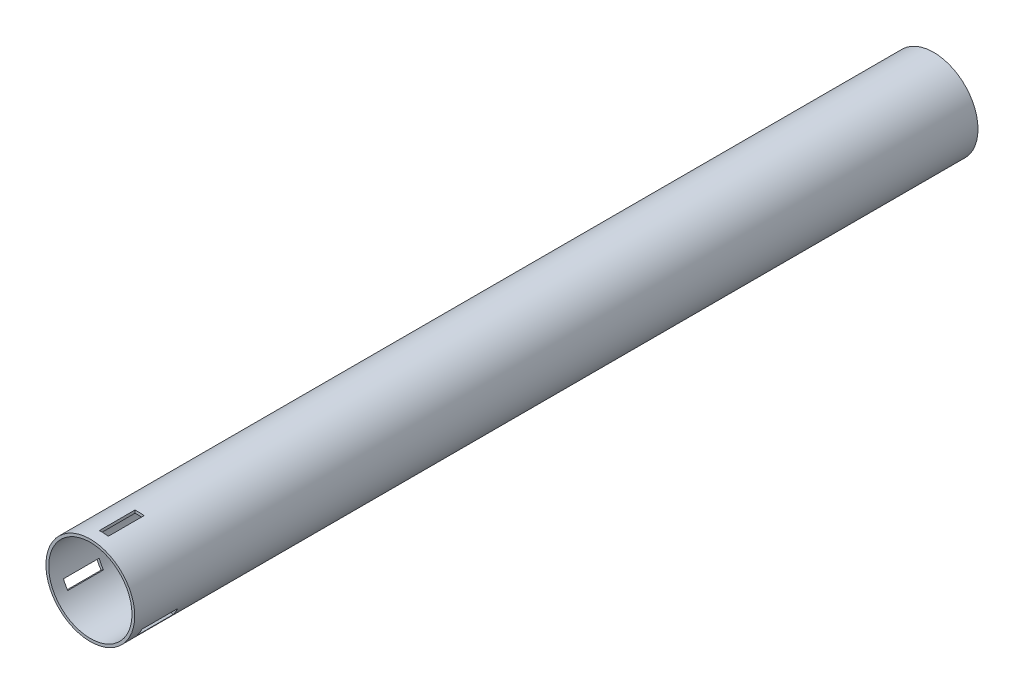
ISO-10303-21;
HEADER;
FILE_DESCRIPTION(('STEP AP214'),'2;1');
FILE_NAME('part.step','',(''),(''),'','','');
FILE_SCHEMA(('AUTOMOTIVE_DESIGN { 1 0 10303 214 1 1 1 1 }'));
ENDSEC;
DATA;
#1=APPLICATION_CONTEXT('core data for automotive mechanical design processes');
#2=APPLICATION_PROTOCOL_DEFINITION('international standard','automotive_design',2000,#1);
#3=PRODUCT_CONTEXT('',#1,'mechanical');
#4=PRODUCT('Part','Part','',(#3));
#5=PRODUCT_RELATED_PRODUCT_CATEGORY('part','',(#4));
#6=PRODUCT_DEFINITION_FORMATION('','',#4);
#7=PRODUCT_DEFINITION_CONTEXT('part definition',#1,'design');
#8=PRODUCT_DEFINITION('design','',#6,#7);
#9=PRODUCT_DEFINITION_SHAPE('','',#8);
#10=(LENGTH_UNIT() NAMED_UNIT(*) SI_UNIT(.MILLI.,.METRE.));
#11=(NAMED_UNIT(*) PLANE_ANGLE_UNIT() SI_UNIT($,.RADIAN.));
#12=(NAMED_UNIT(*) SI_UNIT($,.STERADIAN.) SOLID_ANGLE_UNIT());
#13=UNCERTAINTY_MEASURE_WITH_UNIT(LENGTH_MEASURE(1.E-05),#10,'distance_accuracy_value','');
#14=(GEOMETRIC_REPRESENTATION_CONTEXT(3) GLOBAL_UNCERTAINTY_ASSIGNED_CONTEXT((#13)) GLOBAL_UNIT_ASSIGNED_CONTEXT((#10,
#11,#12)) REPRESENTATION_CONTEXT('',''));
#15=CARTESIAN_POINT('',(0.,0.,0.));
#16=DIRECTION('',(0.,0.,1.));
#17=DIRECTION('',(1.,0.,0.));
#18=AXIS2_PLACEMENT_3D('',#15,#16,#17);
#19=CARTESIAN_POINT('',(0.,0.,450.));
#20=DIRECTION('',(0.,0.,1.));
#21=DIRECTION('',(1.,0.,0.));
#22=AXIS2_PLACEMENT_3D('',#19,#20,#21);
#23=PLANE('',#22);
#24=CARTESIAN_POINT('',(0.,0.,450.));
#25=DIRECTION('',(0.,0.,1.));
#26=DIRECTION('',(1.,0.,0.));
#27=AXIS2_PLACEMENT_3D('',#24,#25,#26);
#28=CIRCLE('',#27,23.6982);
#29=CARTESIAN_POINT('',(23.6982,0.,450.));
#30=VERTEX_POINT('',#29);
#31=EDGE_CURVE('E11',#30,#30,#28,.T.);
#32=ORIENTED_EDGE('',*,*,#31,.T.);
#33=EDGE_LOOP('',(#32));
#34=FACE_BOUND('',#33,.T.);
#35=CARTESIAN_POINT('',(0.,0.,450.));
#36=DIRECTION('',(0.,0.,1.));
#37=DIRECTION('',(1.,0.,0.));
#38=AXIS2_PLACEMENT_3D('',#35,#36,#37);
#39=CIRCLE('',#38,22.225);
#40=CARTESIAN_POINT('',(22.225,0.,450.));
#41=VERTEX_POINT('',#40);
#42=EDGE_CURVE('E225',#41,#41,#39,.T.);
#43=ORIENTED_EDGE('',*,*,#42,.F.);
#44=EDGE_LOOP('',(#43));
#45=FACE_BOUND('',#44,.T.);
#46=ADVANCED_FACE('F33',(#34,#45),#23,.T.);
#47=CARTESIAN_POINT('',(0.,0.,0.));
#48=DIRECTION('',(0.,0.,1.));
#49=DIRECTION('',(1.,0.,0.));
#50=AXIS2_PLACEMENT_3D('',#47,#48,#49);
#51=PLANE('',#50);
#52=CARTESIAN_POINT('',(0.,0.,0.));
#53=DIRECTION('',(0.,0.,1.));
#54=DIRECTION('',(1.,0.,0.));
#55=AXIS2_PLACEMENT_3D('',#52,#53,#54);
#56=CIRCLE('',#55,23.6982);
#57=CARTESIAN_POINT('',(23.6982,0.,0.));
#58=VERTEX_POINT('',#57);
#59=EDGE_CURVE('E37',#58,#58,#56,.T.);
#60=ORIENTED_EDGE('',*,*,#59,.F.);
#61=EDGE_LOOP('',(#60));
#62=FACE_BOUND('',#61,.T.);
#63=CARTESIAN_POINT('',(0.,0.,0.));
#64=DIRECTION('',(0.,0.,1.));
#65=DIRECTION('',(1.,0.,0.));
#66=AXIS2_PLACEMENT_3D('',#63,#64,#65);
#67=CIRCLE('',#66,22.225);
#68=CARTESIAN_POINT('',(22.225,0.,0.));
#69=VERTEX_POINT('',#68);
#70=EDGE_CURVE('E224',#69,#69,#67,.T.);
#71=ORIENTED_EDGE('',*,*,#70,.T.);
#72=EDGE_LOOP('',(#71));
#73=FACE_BOUND('',#72,.T.);
#74=ADVANCED_FACE('F231',(#62,#73),#51,.F.);
#75=CARTESIAN_POINT('',(0.,0.,450.));
#76=DIRECTION('',(0.,0.,-1.));
#77=DIRECTION('',(-1.,0.,0.));
#78=AXIS2_PLACEMENT_3D('',#75,#76,#77);
#79=CYLINDRICAL_SURFACE('',#78,23.6982);
#80=CARTESIAN_POINT('',(0.,0.,424.6));
#81=DIRECTION('',(0.,0.,-1.));
#82=DIRECTION('',(-1.,0.,0.));
#83=AXIS2_PLACEMENT_3D('',#80,#81,#82);
#84=CIRCLE('',#83,23.6982);
#85=CARTESIAN_POINT('',(18.6925778750122,-14.5668189947773,424.6));
#86=VERTEX_POINT('',#85);
#87=CARTESIAN_POINT('',(21.2708932392925,-10.447668832932,424.6));
#88=VERTEX_POINT('',#87);
#89=EDGE_CURVE('E138',#86,#88,#84,.F.);
#90=ORIENTED_EDGE('',*,*,#89,.F.);
#91=DIRECTION('',(0.,0.,-1.));
#92=VECTOR('',#91,1.);
#93=CARTESIAN_POINT('',(18.6925778750122,-14.5668189947773,450.));
#94=LINE('',#93,#92);
#95=CARTESIAN_POINT('',(18.6925778750122,-14.5668189947773,443.65));
#96=VERTEX_POINT('',#95);
#97=EDGE_CURVE('E159',#96,#86,#94,.T.);
#98=ORIENTED_EDGE('',*,*,#97,.F.);
#99=CARTESIAN_POINT('',(0.,0.,443.65));
#100=DIRECTION('',(0.,0.,1.));
#101=DIRECTION('',(1.,0.,0.));
#102=AXIS2_PLACEMENT_3D('',#99,#100,#101);
#103=CIRCLE('',#102,23.6982);
#104=CARTESIAN_POINT('',(21.2708932392925,-10.447668832932,443.65));
#105=VERTEX_POINT('',#104);
#106=EDGE_CURVE('E151',#105,#96,#103,.F.);
#107=ORIENTED_EDGE('',*,*,#106,.F.);
#108=DIRECTION('',(0.,0.,-1.));
#109=VECTOR('',#108,1.);
#110=CARTESIAN_POINT('',(21.2708932392925,-10.447668832932,450.));
#111=LINE('',#110,#109);
#112=EDGE_CURVE('E48',#88,#105,#111,.F.);
#113=ORIENTED_EDGE('',*,*,#112,.F.);
#114=EDGE_LOOP('',(#90,#98,#107,#113));
#115=FACE_BOUND('',#114,.T.);
#116=CARTESIAN_POINT('',(0.,0.,424.6));
#117=DIRECTION('',(0.,0.,-1.));
#118=DIRECTION('',(-1.,0.,0.));
#119=AXIS2_PLACEMENT_3D('',#116,#117,#118);
#120=CIRCLE('',#119,23.6982);
#121=CARTESIAN_POINT('',(-21.961524239313,-8.90483780459073,424.6));
#122=VERTEX_POINT('',#121);
#123=CARTESIAN_POINT('',(-19.6833932392924,-13.1972994899479,424.6));
#124=VERTEX_POINT('',#123);
#125=EDGE_CURVE('E171',#122,#124,#120,.F.);
#126=ORIENTED_EDGE('',*,*,#125,.F.);
#127=DIRECTION('',(0.,0.,-1.));
#128=VECTOR('',#127,1.);
#129=CARTESIAN_POINT('',(-21.961524239313,-8.90483780459073,450.));
#130=LINE('',#129,#128);
#131=CARTESIAN_POINT('',(-21.961524239313,-8.90483780459074,443.65));
#132=VERTEX_POINT('',#131);
#133=EDGE_CURVE('E189',#132,#122,#130,.T.);
#134=ORIENTED_EDGE('',*,*,#133,.F.);
#135=CARTESIAN_POINT('',(0.,0.,443.65));
#136=DIRECTION('',(0.,0.,1.));
#137=DIRECTION('',(1.,0.,0.));
#138=AXIS2_PLACEMENT_3D('',#135,#136,#137);
#139=CIRCLE('',#138,23.6982);
#140=CARTESIAN_POINT('',(-19.6833932392924,-13.1972994899479,443.65));
#141=VERTEX_POINT('',#140);
#142=EDGE_CURVE('E175',#141,#132,#139,.F.);
#143=ORIENTED_EDGE('',*,*,#142,.F.);
#144=DIRECTION('',(0.,0.,-1.));
#145=VECTOR('',#144,1.);
#146=CARTESIAN_POINT('',(-19.6833932392924,-13.1972994899479,450.));
#147=LINE('',#146,#145);
#148=EDGE_CURVE('E56',#124,#141,#147,.F.);
#149=ORIENTED_EDGE('',*,*,#148,.F.);
#150=EDGE_LOOP('',(#126,#134,#143,#149));
#151=FACE_BOUND('',#150,.T.);
#152=CARTESIAN_POINT('',(0.,0.,424.6));
#153=DIRECTION('',(0.,0.,-1.));
#154=DIRECTION('',(-1.,0.,0.));
#155=AXIS2_PLACEMENT_3D('',#152,#153,#154);
#156=CIRCLE('',#155,23.6982);
#157=CARTESIAN_POINT('',(3.26894636430097,23.4716567993681,424.6));
#158=VERTEX_POINT('',#157);
#159=CARTESIAN_POINT('',(-1.5875,23.64496832288,424.6));
#160=VERTEX_POINT('',#159);
#161=EDGE_CURVE('E201',#158,#160,#156,.F.);
#162=ORIENTED_EDGE('',*,*,#161,.F.);
#163=DIRECTION('',(0.,0.,-1.));
#164=VECTOR('',#163,1.);
#165=CARTESIAN_POINT('',(3.26894636430097,23.4716567993681,450.));
#166=LINE('',#165,#164);
#167=CARTESIAN_POINT('',(3.26894636430097,23.4716567993681,443.65));
#168=VERTEX_POINT('',#167);
#169=EDGE_CURVE('E221',#168,#158,#166,.T.);
#170=ORIENTED_EDGE('',*,*,#169,.F.);
#171=CARTESIAN_POINT('',(0.,0.,443.65));
#172=DIRECTION('',(0.,0.,1.));
#173=DIRECTION('',(1.,0.,0.));
#174=AXIS2_PLACEMENT_3D('',#171,#172,#173);
#175=CIRCLE('',#174,23.6982);
#176=CARTESIAN_POINT('',(-1.5875,23.64496832288,443.65));
#177=VERTEX_POINT('',#176);
#178=EDGE_CURVE('E205',#177,#168,#175,.F.);
#179=ORIENTED_EDGE('',*,*,#178,.F.);
#180=DIRECTION('',(0.,0.,-1.));
#181=VECTOR('',#180,1.);
#182=CARTESIAN_POINT('',(-1.5875,23.64496832288,450.));
#183=LINE('',#182,#181);
#184=EDGE_CURVE('E203',#160,#177,#183,.F.);
#185=ORIENTED_EDGE('',*,*,#184,.F.);
#186=EDGE_LOOP('',(#162,#170,#179,#185));
#187=FACE_BOUND('',#186,.T.);
#188=ORIENTED_EDGE('',*,*,#31,.F.);
#189=EDGE_LOOP('',(#188));
#190=FACE_BOUND('',#189,.T.);
#191=ORIENTED_EDGE('',*,*,#59,.T.);
#192=EDGE_LOOP('',(#191));
#193=FACE_BOUND('',#192,.T.);
#194=ADVANCED_FACE('F35',(#115,#151,#187,#190,#193),#79,.T.);
#195=CARTESIAN_POINT('',(0.,0.,450.));
#196=DIRECTION('',(0.,0.,-1.));
#197=DIRECTION('',(-1.,0.,0.));
#198=AXIS2_PLACEMENT_3D('',#195,#196,#197);
#199=CYLINDRICAL_SURFACE('',#198,22.225);
#200=DIRECTION('',(0.,0.,-1.));
#201=VECTOR('',#200,1.);
#202=CARTESIAN_POINT('',(17.403606053962,-13.8226307669162,450.));
#203=LINE('',#202,#201);
#204=CARTESIAN_POINT('',(17.403606053962,-13.8226307669162,443.65));
#205=VERTEX_POINT('',#204);
#206=CARTESIAN_POINT('',(17.403606053962,-13.8226307669162,424.6));
#207=VERTEX_POINT('',#206);
#208=EDGE_CURVE('E145',#205,#207,#203,.T.);
#209=ORIENTED_EDGE('',*,*,#208,.T.);
#210=CARTESIAN_POINT('',(0.,0.,424.6));
#211=DIRECTION('',(0.,0.,-1.));
#212=DIRECTION('',(-1.,0.,0.));
#213=AXIS2_PLACEMENT_3D('',#210,#211,#212);
#214=CIRCLE('',#213,22.225);
#215=CARTESIAN_POINT('',(19.992001263136,-9.70930020623361,424.6));
#216=VERTEX_POINT('',#215);
#217=EDGE_CURVE('E132',#207,#216,#214,.F.);
#218=ORIENTED_EDGE('',*,*,#217,.T.);
#219=DIRECTION('',(0.,0.,-1.));
#220=VECTOR('',#219,1.);
#221=CARTESIAN_POINT('',(19.992001263136,-9.70930020623361,450.));
#222=LINE('',#221,#220);
#223=CARTESIAN_POINT('',(19.992001263136,-9.70930020623361,443.65));
#224=VERTEX_POINT('',#223);
#225=EDGE_CURVE('E122',#216,#224,#222,.F.);
#226=ORIENTED_EDGE('',*,*,#225,.T.);
#227=CARTESIAN_POINT('',(0.,0.,443.65));
#228=DIRECTION('',(0.,0.,1.));
#229=DIRECTION('',(1.,0.,0.));
#230=AXIS2_PLACEMENT_3D('',#227,#228,#229);
#231=CIRCLE('',#230,22.225);
#232=EDGE_CURVE('E131',#224,#205,#231,.F.);
#233=ORIENTED_EDGE('',*,*,#232,.T.);
#234=EDGE_LOOP('',(#209,#218,#226,#233));
#235=FACE_BOUND('',#234,.T.);
#236=DIRECTION('',(0.,0.,-1.));
#237=VECTOR('',#236,1.);
#238=CARTESIAN_POINT('',(-20.6725524182628,-8.16064957672957,450.));
#239=LINE('',#238,#237);
#240=CARTESIAN_POINT('',(-20.6725524182628,-8.16064957672956,443.65));
#241=VERTEX_POINT('',#240);
#242=CARTESIAN_POINT('',(-20.6725524182628,-8.16064957672957,424.6));
#243=VERTEX_POINT('',#242);
#244=EDGE_CURVE('E181',#241,#243,#239,.T.);
#245=ORIENTED_EDGE('',*,*,#244,.T.);
#246=CARTESIAN_POINT('',(0.,0.,424.6));
#247=DIRECTION('',(0.,0.,-1.));
#248=DIRECTION('',(-1.,0.,0.));
#249=AXIS2_PLACEMENT_3D('',#246,#247,#248);
#250=CIRCLE('',#249,22.225);
#251=CARTESIAN_POINT('',(-18.4045012631359,-12.4589308632495,424.6));
#252=VERTEX_POINT('',#251);
#253=EDGE_CURVE('E162',#243,#252,#250,.F.);
#254=ORIENTED_EDGE('',*,*,#253,.T.);
#255=DIRECTION('',(0.,0.,-1.));
#256=VECTOR('',#255,1.);
#257=CARTESIAN_POINT('',(-18.4045012631359,-12.4589308632495,450.));
#258=LINE('',#257,#256);
#259=CARTESIAN_POINT('',(-18.4045012631359,-12.4589308632495,443.65));
#260=VERTEX_POINT('',#259);
#261=EDGE_CURVE('E165',#252,#260,#258,.F.);
#262=ORIENTED_EDGE('',*,*,#261,.T.);
#263=CARTESIAN_POINT('',(0.,0.,443.65));
#264=DIRECTION('',(0.,0.,1.));
#265=DIRECTION('',(1.,0.,0.));
#266=AXIS2_PLACEMENT_3D('',#263,#264,#265);
#267=CIRCLE('',#266,22.225);
#268=EDGE_CURVE('E168',#260,#241,#267,.F.);
#269=ORIENTED_EDGE('',*,*,#268,.T.);
#270=EDGE_LOOP('',(#245,#254,#262,#269));
#271=FACE_BOUND('',#270,.T.);
#272=DIRECTION('',(0.,0.,-1.));
#273=VECTOR('',#272,1.);
#274=CARTESIAN_POINT('',(3.26894636430097,21.9832803436458,450.));
#275=LINE('',#274,#273);
#276=CARTESIAN_POINT('',(3.26894636430097,21.9832803436458,443.65));
#277=VERTEX_POINT('',#276);
#278=CARTESIAN_POINT('',(3.26894636430097,21.9832803436458,424.6));
#279=VERTEX_POINT('',#278);
#280=EDGE_CURVE('E211',#277,#279,#275,.T.);
#281=ORIENTED_EDGE('',*,*,#280,.T.);
#282=CARTESIAN_POINT('',(0.,0.,424.6));
#283=DIRECTION('',(0.,0.,-1.));
#284=DIRECTION('',(-1.,0.,0.));
#285=AXIS2_PLACEMENT_3D('',#282,#283,#284);
#286=CIRCLE('',#285,22.225);
#287=CARTESIAN_POINT('',(-1.5875,22.1682310694832,424.6));
#288=VERTEX_POINT('',#287);
#289=EDGE_CURVE('E192',#279,#288,#286,.F.);
#290=ORIENTED_EDGE('',*,*,#289,.T.);
#291=DIRECTION('',(0.,0.,-1.));
#292=VECTOR('',#291,1.);
#293=CARTESIAN_POINT('',(-1.5875,22.1682310694832,450.));
#294=LINE('',#293,#292);
#295=CARTESIAN_POINT('',(-1.5875,22.1682310694832,443.65));
#296=VERTEX_POINT('',#295);
#297=EDGE_CURVE('E195',#288,#296,#294,.F.);
#298=ORIENTED_EDGE('',*,*,#297,.T.);
#299=CARTESIAN_POINT('',(0.,0.,443.65));
#300=DIRECTION('',(0.,0.,1.));
#301=DIRECTION('',(1.,0.,0.));
#302=AXIS2_PLACEMENT_3D('',#299,#300,#301);
#303=CIRCLE('',#302,22.225);
#304=EDGE_CURVE('E198',#296,#277,#303,.F.);
#305=ORIENTED_EDGE('',*,*,#304,.T.);
#306=EDGE_LOOP('',(#281,#290,#298,#305));
#307=FACE_BOUND('',#306,.T.);
#308=ORIENTED_EDGE('',*,*,#42,.T.);
#309=EDGE_LOOP('',(#308));
#310=FACE_BOUND('',#309,.T.);
#311=ORIENTED_EDGE('',*,*,#70,.F.);
#312=EDGE_LOOP('',(#311));
#313=FACE_BOUND('',#312,.T.);
#314=ADVANCED_FACE('F142',(#235,#271,#307,#310,#313),#199,.F.);
#315=CARTESIAN_POINT('',(3.26894636430097,-23.6992,443.65));
#316=DIRECTION('',(1.,0.,0.));
#317=DIRECTION('',(0.,0.,-1.));
#318=AXIS2_PLACEMENT_3D('',#315,#316,#317);
#319=PLANE('',#318);
#320=ORIENTED_EDGE('',*,*,#169,.T.);
#321=DIRECTION('',(0.,1.,0.));
#322=VECTOR('',#321,1.);
#323=CARTESIAN_POINT('',(3.26894636430097,-23.6992,424.6));
#324=LINE('',#323,#322);
#325=EDGE_CURVE('E215',#279,#158,#324,.T.);
#326=ORIENTED_EDGE('',*,*,#325,.F.);
#327=ORIENTED_EDGE('',*,*,#280,.F.);
#328=DIRECTION('',(0.,1.,0.));
#329=VECTOR('',#328,1.);
#330=CARTESIAN_POINT('',(3.26894636430097,-23.6992,443.65));
#331=LINE('',#330,#329);
#332=EDGE_CURVE('E207',#277,#168,#331,.T.);
#333=ORIENTED_EDGE('',*,*,#332,.T.);
#334=EDGE_LOOP('',(#320,#326,#327,#333));
#335=FACE_BOUND('',#334,.T.);
#336=ADVANCED_FACE('F234',(#335),#319,.F.);
#337=CARTESIAN_POINT('',(-1.5875,-23.6992,424.6));
#338=DIRECTION('',(0.,0.,-1.));
#339=DIRECTION('',(-1.,0.,0.));
#340=AXIS2_PLACEMENT_3D('',#337,#338,#339);
#341=PLANE('',#340);
#342=ORIENTED_EDGE('',*,*,#161,.T.);
#343=DIRECTION('',(0.,1.,0.));
#344=VECTOR('',#343,1.);
#345=CARTESIAN_POINT('',(-1.5875,-23.6992,424.6));
#346=LINE('',#345,#344);
#347=EDGE_CURVE('E212',#288,#160,#346,.T.);
#348=ORIENTED_EDGE('',*,*,#347,.F.);
#349=ORIENTED_EDGE('',*,*,#289,.F.);
#350=ORIENTED_EDGE('',*,*,#325,.T.);
#351=EDGE_LOOP('',(#342,#348,#349,#350));
#352=FACE_BOUND('',#351,.T.);
#353=ADVANCED_FACE('F240',(#352),#341,.F.);
#354=CARTESIAN_POINT('',(-1.5875,-23.6992,443.65));
#355=DIRECTION('',(-1.,0.,0.));
#356=DIRECTION('',(0.,0.,1.));
#357=AXIS2_PLACEMENT_3D('',#354,#355,#356);
#358=PLANE('',#357);
#359=ORIENTED_EDGE('',*,*,#184,.T.);
#360=DIRECTION('',(0.,1.,0.));
#361=VECTOR('',#360,1.);
#362=CARTESIAN_POINT('',(-1.5875,-23.6992,443.65));
#363=LINE('',#362,#361);
#364=EDGE_CURVE('E208',#296,#177,#363,.T.);
#365=ORIENTED_EDGE('',*,*,#364,.F.);
#366=ORIENTED_EDGE('',*,*,#297,.F.);
#367=ORIENTED_EDGE('',*,*,#347,.T.);
#368=EDGE_LOOP('',(#359,#365,#366,#367));
#369=FACE_BOUND('',#368,.T.);
#370=ADVANCED_FACE('F358',(#369),#358,.F.);
#371=CARTESIAN_POINT('',(-1.5875,-23.6992,443.65));
#372=DIRECTION('',(0.,0.,1.));
#373=DIRECTION('',(1.,0.,0.));
#374=AXIS2_PLACEMENT_3D('',#371,#372,#373);
#375=PLANE('',#374);
#376=ORIENTED_EDGE('',*,*,#178,.T.);
#377=ORIENTED_EDGE('',*,*,#332,.F.);
#378=ORIENTED_EDGE('',*,*,#304,.F.);
#379=ORIENTED_EDGE('',*,*,#364,.T.);
#380=EDGE_LOOP('',(#376,#377,#378,#379));
#381=FACE_BOUND('',#380,.T.);
#382=ADVANCED_FACE('F273',(#381),#375,.F.);
#383=CARTESIAN_POINT('',(26.4019814425335,19.0178452197776,443.65));
#384=DIRECTION('',(-0.500000000000004,0.866025403784436,0.));
#385=DIRECTION('',(-0.866025403784436,-0.500000000000004,0.));
#386=AXIS2_PLACEMENT_3D('',#383,#384,#385);
#387=PLANE('',#386);
#388=ORIENTED_EDGE('',*,*,#133,.T.);
#389=DIRECTION('',(-0.866025403784436,-0.500000000000004,0.));
#390=VECTOR('',#389,1.);
#391=CARTESIAN_POINT('',(26.4019814425335,19.0178452197776,424.6));
#392=LINE('',#391,#390);
#393=EDGE_CURVE('E184',#243,#122,#392,.T.);
#394=ORIENTED_EDGE('',*,*,#393,.F.);
#395=ORIENTED_EDGE('',*,*,#244,.F.);
#396=DIRECTION('',(-0.866025403784436,-0.500000000000004,0.));
#397=VECTOR('',#396,1.);
#398=CARTESIAN_POINT('',(26.4019814425335,19.0178452197776,443.65));
#399=LINE('',#398,#397);
#400=EDGE_CURVE('E178',#241,#132,#399,.T.);
#401=ORIENTED_EDGE('',*,*,#400,.T.);
#402=EDGE_LOOP('',(#388,#394,#395,#401));
#403=FACE_BOUND('',#402,.T.);
#404=ADVANCED_FACE('F283',(#403),#387,.F.);
#405=CARTESIAN_POINT('',(28.830204624684,14.8120392961764,424.6));
#406=DIRECTION('',(0.,0.,-1.));
#407=DIRECTION('',(-1.,0.,0.));
#408=AXIS2_PLACEMENT_3D('',#405,#406,#407);
#409=PLANE('',#408);
#410=ORIENTED_EDGE('',*,*,#125,.T.);
#411=DIRECTION('',(-0.866025403784436,-0.500000000000004,0.));
#412=VECTOR('',#411,1.);
#413=CARTESIAN_POINT('',(28.830204624684,14.8120392961764,424.6));
#414=LINE('',#413,#412);
#415=EDGE_CURVE('E182',#252,#124,#414,.T.);
#416=ORIENTED_EDGE('',*,*,#415,.F.);
#417=ORIENTED_EDGE('',*,*,#253,.F.);
#418=ORIENTED_EDGE('',*,*,#393,.T.);
#419=EDGE_LOOP('',(#410,#416,#417,#418));
#420=FACE_BOUND('',#419,.T.);
#421=ADVANCED_FACE('F288',(#420),#409,.F.);
#422=CARTESIAN_POINT('',(28.830204624684,14.8120392961764,443.65));
#423=DIRECTION('',(0.500000000000004,-0.866025403784436,0.));
#424=DIRECTION('',(0.866025403784436,0.500000000000004,0.));
#425=AXIS2_PLACEMENT_3D('',#422,#423,#424);
#426=PLANE('',#425);
#427=ORIENTED_EDGE('',*,*,#148,.T.);
#428=DIRECTION('',(-0.866025403784436,-0.500000000000004,0.));
#429=VECTOR('',#428,1.);
#430=CARTESIAN_POINT('',(28.830204624684,14.8120392961764,443.65));
#431=LINE('',#430,#429);
#432=EDGE_CURVE('E179',#260,#141,#431,.T.);
#433=ORIENTED_EDGE('',*,*,#432,.F.);
#434=ORIENTED_EDGE('',*,*,#261,.F.);
#435=ORIENTED_EDGE('',*,*,#415,.T.);
#436=EDGE_LOOP('',(#427,#433,#434,#435));
#437=FACE_BOUND('',#436,.T.);
#438=ADVANCED_FACE('F298',(#437),#426,.F.);
#439=CARTESIAN_POINT('',(28.830204624684,14.8120392961764,443.65));
#440=DIRECTION('',(0.,0.,1.));
#441=DIRECTION('',(1.,0.,0.));
#442=AXIS2_PLACEMENT_3D('',#439,#440,#441);
#443=PLANE('',#442);
#444=ORIENTED_EDGE('',*,*,#142,.T.);
#445=ORIENTED_EDGE('',*,*,#400,.F.);
#446=ORIENTED_EDGE('',*,*,#268,.F.);
#447=ORIENTED_EDGE('',*,*,#432,.T.);
#448=EDGE_LOOP('',(#444,#445,#446,#447));
#449=FACE_BOUND('',#448,.T.);
#450=ADVANCED_FACE('F308',(#449),#443,.F.);
#451=CARTESIAN_POINT('',(-29.6709278068346,13.3558640295903,443.65));
#452=DIRECTION('',(-0.499999999999992,-0.866025403784443,0.));
#453=DIRECTION('',(0.866025403784443,-0.499999999999992,0.));
#454=AXIS2_PLACEMENT_3D('',#451,#452,#453);
#455=PLANE('',#454);
#456=ORIENTED_EDGE('',*,*,#97,.T.);
#457=DIRECTION('',(0.866025403784443,-0.499999999999992,0.));
#458=VECTOR('',#457,1.);
#459=CARTESIAN_POINT('',(-29.6709278068346,13.3558640295903,424.6));
#460=LINE('',#459,#458);
#461=EDGE_CURVE('E139',#207,#86,#460,.T.);
#462=ORIENTED_EDGE('',*,*,#461,.F.);
#463=ORIENTED_EDGE('',*,*,#208,.F.);
#464=DIRECTION('',(0.866025403784443,-0.499999999999992,0.));
#465=VECTOR('',#464,1.);
#466=CARTESIAN_POINT('',(-29.6709278068346,13.3558640295903,443.65));
#467=LINE('',#466,#465);
#468=EDGE_CURVE('E154',#205,#96,#467,.T.);
#469=ORIENTED_EDGE('',*,*,#468,.T.);
#470=EDGE_LOOP('',(#456,#462,#463,#469));
#471=FACE_BOUND('',#470,.T.);
#472=ADVANCED_FACE('F317',(#471),#455,.F.);
#473=CARTESIAN_POINT('',(-27.2427046246842,17.5616699531916,424.6));
#474=DIRECTION('',(0.,0.,-1.));
#475=DIRECTION('',(-1.,0.,0.));
#476=AXIS2_PLACEMENT_3D('',#473,#474,#475);
#477=PLANE('',#476);
#478=ORIENTED_EDGE('',*,*,#89,.T.);
#479=DIRECTION('',(0.866025403784443,-0.499999999999992,0.));
#480=VECTOR('',#479,1.);
#481=CARTESIAN_POINT('',(-27.2427046246842,17.5616699531916,424.6));
#482=LINE('',#481,#480);
#483=EDGE_CURVE('E125',#216,#88,#482,.T.);
#484=ORIENTED_EDGE('',*,*,#483,.F.);
#485=ORIENTED_EDGE('',*,*,#217,.F.);
#486=ORIENTED_EDGE('',*,*,#461,.T.);
#487=EDGE_LOOP('',(#478,#484,#485,#486));
#488=FACE_BOUND('',#487,.T.);
#489=ADVANCED_FACE('F135',(#488),#477,.F.);
#490=CARTESIAN_POINT('',(-27.2427046246842,17.5616699531916,443.65));
#491=DIRECTION('',(0.499999999999992,0.866025403784443,0.));
#492=DIRECTION('',(-0.866025403784443,0.499999999999992,0.));
#493=AXIS2_PLACEMENT_3D('',#490,#491,#492);
#494=PLANE('',#493);
#495=ORIENTED_EDGE('',*,*,#112,.T.);
#496=DIRECTION('',(0.866025403784443,-0.499999999999992,0.));
#497=VECTOR('',#496,1.);
#498=CARTESIAN_POINT('',(-27.2427046246842,17.5616699531916,443.65));
#499=LINE('',#498,#497);
#500=EDGE_CURVE('E127',#224,#105,#499,.T.);
#501=ORIENTED_EDGE('',*,*,#500,.F.);
#502=ORIENTED_EDGE('',*,*,#225,.F.);
#503=ORIENTED_EDGE('',*,*,#483,.T.);
#504=EDGE_LOOP('',(#495,#501,#502,#503));
#505=FACE_BOUND('',#504,.T.);
#506=ADVANCED_FACE('F124',(#505),#494,.F.);
#507=CARTESIAN_POINT('',(-27.2427046246842,17.5616699531916,443.65));
#508=DIRECTION('',(0.,0.,1.));
#509=DIRECTION('',(1.,0.,0.));
#510=AXIS2_PLACEMENT_3D('',#507,#508,#509);
#511=PLANE('',#510);
#512=ORIENTED_EDGE('',*,*,#106,.T.);
#513=ORIENTED_EDGE('',*,*,#468,.F.);
#514=ORIENTED_EDGE('',*,*,#232,.F.);
#515=ORIENTED_EDGE('',*,*,#500,.T.);
#516=EDGE_LOOP('',(#512,#513,#514,#515));
#517=FACE_BOUND('',#516,.T.);
#518=ADVANCED_FACE('F344',(#517),#511,.F.);
#519=CLOSED_SHELL('',(#46,#74,#194,#314,#336,#353,#370,#382,#404,#421,#438,#450,#472,#489,#506,#518));
#520=MANIFOLD_SOLID_BREP('B2',#519);
#521=ADVANCED_BREP_SHAPE_REPRESENTATION('',(#18,#520),#14);
#522=SHAPE_DEFINITION_REPRESENTATION(#9,#521);
ENDSEC;
END-ISO-10303-21;
